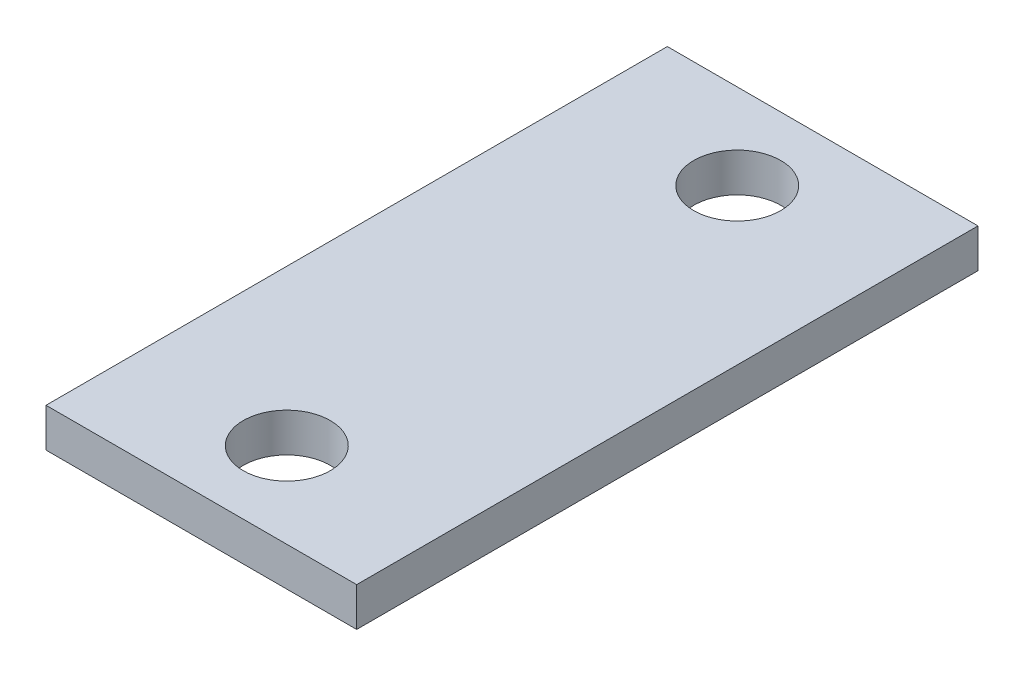
ISO-10303-21;
HEADER;
FILE_DESCRIPTION(('STEP AP214'),'2;1');
FILE_NAME('part.step','',(''),(''),'','','');
FILE_SCHEMA(('AUTOMOTIVE_DESIGN { 1 0 10303 214 1 1 1 1 }'));
ENDSEC;
DATA;
#1=APPLICATION_CONTEXT('core data for automotive mechanical design processes');
#2=APPLICATION_PROTOCOL_DEFINITION('international standard','automotive_design',2000,#1);
#3=PRODUCT_CONTEXT('',#1,'mechanical');
#4=PRODUCT('Part','Part','',(#3));
#5=PRODUCT_RELATED_PRODUCT_CATEGORY('part','',(#4));
#6=PRODUCT_DEFINITION_FORMATION('','',#4);
#7=PRODUCT_DEFINITION_CONTEXT('part definition',#1,'design');
#8=PRODUCT_DEFINITION('design','',#6,#7);
#9=PRODUCT_DEFINITION_SHAPE('','',#8);
#10=(LENGTH_UNIT() NAMED_UNIT(*) SI_UNIT(.MILLI.,.METRE.));
#11=(NAMED_UNIT(*) PLANE_ANGLE_UNIT() SI_UNIT($,.RADIAN.));
#12=(NAMED_UNIT(*) SI_UNIT($,.STERADIAN.) SOLID_ANGLE_UNIT());
#13=UNCERTAINTY_MEASURE_WITH_UNIT(LENGTH_MEASURE(1.E-05),#10,'distance_accuracy_value','');
#14=(GEOMETRIC_REPRESENTATION_CONTEXT(3) GLOBAL_UNCERTAINTY_ASSIGNED_CONTEXT((#13)) GLOBAL_UNIT_ASSIGNED_CONTEXT((#10,
#11,#12)) REPRESENTATION_CONTEXT('',''));
#15=CARTESIAN_POINT('',(0.,0.,0.));
#16=DIRECTION('',(0.,0.,1.));
#17=DIRECTION('',(1.,0.,0.));
#18=AXIS2_PLACEMENT_3D('',#15,#16,#17);
#19=CARTESIAN_POINT('',(0.,6.35,0.));
#20=DIRECTION('',(0.,-1.,0.));
#21=DIRECTION('',(0.,0.,-1.));
#22=AXIS2_PLACEMENT_3D('',#19,#20,#21);
#23=PLANE('',#22);
#24=DIRECTION('',(0.,0.,1.));
#25=VECTOR('',#24,1.);
#26=CARTESIAN_POINT('',(0.,6.35,0.));
#27=LINE('',#26,#25);
#28=CARTESIAN_POINT('',(0.,6.35,-101.6));
#29=VERTEX_POINT('',#28);
#30=CARTESIAN_POINT('',(0.,6.35,0.));
#31=VERTEX_POINT('',#30);
#32=EDGE_CURVE('E92',#29,#31,#27,.T.);
#33=ORIENTED_EDGE('',*,*,#32,.T.);
#34=DIRECTION('',(1.,0.,0.));
#35=VECTOR('',#34,1.);
#36=CARTESIAN_POINT('',(0.,6.35,0.));
#37=LINE('',#36,#35);
#38=CARTESIAN_POINT('',(50.8,6.35,0.));
#39=VERTEX_POINT('',#38);
#40=EDGE_CURVE('E87',#31,#39,#37,.T.);
#41=ORIENTED_EDGE('',*,*,#40,.T.);
#42=DIRECTION('',(0.,0.,-1.));
#43=VECTOR('',#42,1.);
#44=CARTESIAN_POINT('',(50.8,6.35,0.));
#45=LINE('',#44,#43);
#46=CARTESIAN_POINT('',(50.8,6.35,-101.6));
#47=VERTEX_POINT('',#46);
#48=EDGE_CURVE('E90',#39,#47,#45,.T.);
#49=ORIENTED_EDGE('',*,*,#48,.T.);
#50=DIRECTION('',(-1.,0.,0.));
#51=VECTOR('',#50,1.);
#52=CARTESIAN_POINT('',(0.,6.35,-101.6));
#53=LINE('',#52,#51);
#54=EDGE_CURVE('E57',#47,#29,#53,.T.);
#55=ORIENTED_EDGE('',*,*,#54,.T.);
#56=EDGE_LOOP('',(#33,#41,#49,#55));
#57=FACE_BOUND('',#56,.T.);
#58=CARTESIAN_POINT('',(25.4,6.35,-13.97));
#59=DIRECTION('',(0.,1.,0.));
#60=DIRECTION('',(0.,0.,1.));
#61=AXIS2_PLACEMENT_3D('',#58,#59,#60);
#62=CIRCLE('',#61,7.112);
#63=CARTESIAN_POINT('',(25.4,6.35,-6.858));
#64=VERTEX_POINT('',#63);
#65=EDGE_CURVE('E112',#64,#64,#62,.T.);
#66=ORIENTED_EDGE('',*,*,#65,.F.);
#67=EDGE_LOOP('',(#66));
#68=FACE_BOUND('',#67,.T.);
#69=CARTESIAN_POINT('',(25.4,6.35,-87.63));
#70=DIRECTION('',(0.,1.,0.));
#71=DIRECTION('',(0.,0.,1.));
#72=AXIS2_PLACEMENT_3D('',#69,#70,#71);
#73=CIRCLE('',#72,7.112);
#74=CARTESIAN_POINT('',(25.4,6.35,-80.518));
#75=VERTEX_POINT('',#74);
#76=EDGE_CURVE('E134',#75,#75,#73,.T.);
#77=ORIENTED_EDGE('',*,*,#76,.F.);
#78=EDGE_LOOP('',(#77));
#79=FACE_BOUND('',#78,.T.);
#80=ADVANCED_FACE('F39',(#57,#68,#79),#23,.F.);
#81=CARTESIAN_POINT('',(0.,0.,0.));
#82=DIRECTION('',(0.,-1.,0.));
#83=DIRECTION('',(0.,0.,-1.));
#84=AXIS2_PLACEMENT_3D('',#81,#82,#83);
#85=PLANE('',#84);
#86=CARTESIAN_POINT('',(25.4,0.,-13.97));
#87=DIRECTION('',(0.,1.,0.));
#88=DIRECTION('',(0.,0.,1.));
#89=AXIS2_PLACEMENT_3D('',#86,#87,#88);
#90=CIRCLE('',#89,7.112);
#91=CARTESIAN_POINT('',(25.4,0.,-6.858));
#92=VERTEX_POINT('',#91);
#93=EDGE_CURVE('E130',#92,#92,#90,.T.);
#94=ORIENTED_EDGE('',*,*,#93,.T.);
#95=EDGE_LOOP('',(#94));
#96=FACE_BOUND('',#95,.T.);
#97=DIRECTION('',(0.,0.,1.));
#98=VECTOR('',#97,1.);
#99=CARTESIAN_POINT('',(0.,0.,0.));
#100=LINE('',#99,#98);
#101=CARTESIAN_POINT('',(0.,0.,-101.6));
#102=VERTEX_POINT('',#101);
#103=CARTESIAN_POINT('',(0.,0.,0.));
#104=VERTEX_POINT('',#103);
#105=EDGE_CURVE('E108',#102,#104,#100,.T.);
#106=ORIENTED_EDGE('',*,*,#105,.F.);
#107=DIRECTION('',(-1.,0.,0.));
#108=VECTOR('',#107,1.);
#109=CARTESIAN_POINT('',(0.,0.,-101.6));
#110=LINE('',#109,#108);
#111=CARTESIAN_POINT('',(50.8,0.,-101.6));
#112=VERTEX_POINT('',#111);
#113=EDGE_CURVE('E80',#112,#102,#110,.T.);
#114=ORIENTED_EDGE('',*,*,#113,.F.);
#115=DIRECTION('',(0.,0.,-1.));
#116=VECTOR('',#115,1.);
#117=CARTESIAN_POINT('',(50.8,0.,0.));
#118=LINE('',#117,#116);
#119=CARTESIAN_POINT('',(50.8,0.,0.));
#120=VERTEX_POINT('',#119);
#121=EDGE_CURVE('E74',#120,#112,#118,.T.);
#122=ORIENTED_EDGE('',*,*,#121,.F.);
#123=DIRECTION('',(1.,0.,0.));
#124=VECTOR('',#123,1.);
#125=CARTESIAN_POINT('',(0.,0.,0.));
#126=LINE('',#125,#124);
#127=EDGE_CURVE('E97',#104,#120,#126,.T.);
#128=ORIENTED_EDGE('',*,*,#127,.F.);
#129=EDGE_LOOP('',(#106,#114,#122,#128));
#130=FACE_BOUND('',#129,.T.);
#131=CARTESIAN_POINT('',(25.4,0.,-87.63));
#132=DIRECTION('',(0.,1.,0.));
#133=DIRECTION('',(0.,0.,1.));
#134=AXIS2_PLACEMENT_3D('',#131,#132,#133);
#135=CIRCLE('',#134,7.112);
#136=CARTESIAN_POINT('',(25.4,0.,-80.518));
#137=VERTEX_POINT('',#136);
#138=EDGE_CURVE('E138',#137,#137,#135,.T.);
#139=ORIENTED_EDGE('',*,*,#138,.T.);
#140=EDGE_LOOP('',(#139));
#141=FACE_BOUND('',#140,.T.);
#142=ADVANCED_FACE('F125',(#96,#130,#141),#85,.T.);
#143=CARTESIAN_POINT('',(0.,6.35,0.));
#144=DIRECTION('',(1.,0.,0.));
#145=DIRECTION('',(0.,0.,-1.));
#146=AXIS2_PLACEMENT_3D('',#143,#144,#145);
#147=PLANE('',#146);
#148=ORIENTED_EDGE('',*,*,#105,.T.);
#149=DIRECTION('',(0.,-1.,0.));
#150=VECTOR('',#149,1.);
#151=CARTESIAN_POINT('',(0.,6.35,0.));
#152=LINE('',#151,#150);
#153=EDGE_CURVE('E11',#31,#104,#152,.T.);
#154=ORIENTED_EDGE('',*,*,#153,.F.);
#155=ORIENTED_EDGE('',*,*,#32,.F.);
#156=DIRECTION('',(0.,-1.,0.));
#157=VECTOR('',#156,1.);
#158=CARTESIAN_POINT('',(0.,6.35,-101.6));
#159=LINE('',#158,#157);
#160=EDGE_CURVE('E104',#29,#102,#159,.T.);
#161=ORIENTED_EDGE('',*,*,#160,.T.);
#162=EDGE_LOOP('',(#148,#154,#155,#161));
#163=FACE_BOUND('',#162,.T.);
#164=ADVANCED_FACE('F41',(#163),#147,.F.);
#165=CARTESIAN_POINT('',(0.,6.35,0.));
#166=DIRECTION('',(0.,0.,-1.));
#167=DIRECTION('',(-1.,0.,0.));
#168=AXIS2_PLACEMENT_3D('',#165,#166,#167);
#169=PLANE('',#168);
#170=ORIENTED_EDGE('',*,*,#127,.T.);
#171=DIRECTION('',(0.,-1.,0.));
#172=VECTOR('',#171,1.);
#173=CARTESIAN_POINT('',(50.8,6.35,0.));
#174=LINE('',#173,#172);
#175=EDGE_CURVE('E49',#39,#120,#174,.T.);
#176=ORIENTED_EDGE('',*,*,#175,.F.);
#177=ORIENTED_EDGE('',*,*,#40,.F.);
#178=ORIENTED_EDGE('',*,*,#153,.T.);
#179=EDGE_LOOP('',(#170,#176,#177,#178));
#180=FACE_BOUND('',#179,.T.);
#181=ADVANCED_FACE('F96',(#180),#169,.F.);
#182=CARTESIAN_POINT('',(50.8,6.35,0.));
#183=DIRECTION('',(-1.,0.,0.));
#184=DIRECTION('',(0.,0.,1.));
#185=AXIS2_PLACEMENT_3D('',#182,#183,#184);
#186=PLANE('',#185);
#187=ORIENTED_EDGE('',*,*,#121,.T.);
#188=DIRECTION('',(0.,-1.,0.));
#189=VECTOR('',#188,1.);
#190=CARTESIAN_POINT('',(50.8,6.35,-101.6));
#191=LINE('',#190,#189);
#192=EDGE_CURVE('E99',#47,#112,#191,.T.);
#193=ORIENTED_EDGE('',*,*,#192,.F.);
#194=ORIENTED_EDGE('',*,*,#48,.F.);
#195=ORIENTED_EDGE('',*,*,#175,.T.);
#196=EDGE_LOOP('',(#187,#193,#194,#195));
#197=FACE_BOUND('',#196,.T.);
#198=ADVANCED_FACE('F100',(#197),#186,.F.);
#199=CARTESIAN_POINT('',(0.,6.35,-101.6));
#200=DIRECTION('',(0.,0.,1.));
#201=DIRECTION('',(1.,0.,0.));
#202=AXIS2_PLACEMENT_3D('',#199,#200,#201);
#203=PLANE('',#202);
#204=ORIENTED_EDGE('',*,*,#113,.T.);
#205=ORIENTED_EDGE('',*,*,#160,.F.);
#206=ORIENTED_EDGE('',*,*,#54,.F.);
#207=ORIENTED_EDGE('',*,*,#192,.T.);
#208=EDGE_LOOP('',(#204,#205,#206,#207));
#209=FACE_BOUND('',#208,.T.);
#210=ADVANCED_FACE('F122',(#209),#203,.F.);
#211=CARTESIAN_POINT('',(25.4,6.35,-13.97));
#212=DIRECTION('',(0.,-1.,0.));
#213=DIRECTION('',(0.,0.,-1.));
#214=AXIS2_PLACEMENT_3D('',#211,#212,#213);
#215=CYLINDRICAL_SURFACE('',#214,7.112);
#216=ORIENTED_EDGE('',*,*,#65,.T.);
#217=EDGE_LOOP('',(#216));
#218=FACE_BOUND('',#217,.T.);
#219=ORIENTED_EDGE('',*,*,#93,.F.);
#220=EDGE_LOOP('',(#219));
#221=FACE_BOUND('',#220,.T.);
#222=ADVANCED_FACE('F157',(#218,#221),#215,.F.);
#223=CARTESIAN_POINT('',(25.4,6.35,-87.63));
#224=DIRECTION('',(0.,-1.,0.));
#225=DIRECTION('',(0.,0.,-1.));
#226=AXIS2_PLACEMENT_3D('',#223,#224,#225);
#227=CYLINDRICAL_SURFACE('',#226,7.112);
#228=ORIENTED_EDGE('',*,*,#76,.T.);
#229=EDGE_LOOP('',(#228));
#230=FACE_BOUND('',#229,.T.);
#231=ORIENTED_EDGE('',*,*,#138,.F.);
#232=EDGE_LOOP('',(#231));
#233=FACE_BOUND('',#232,.T.);
#234=ADVANCED_FACE('F146',(#230,#233),#227,.F.);
#235=CLOSED_SHELL('',(#80,#142,#164,#181,#198,#210,#222,#234));
#236=MANIFOLD_SOLID_BREP('B2',#235);
#237=ADVANCED_BREP_SHAPE_REPRESENTATION('',(#18,#236),#14);
#238=SHAPE_DEFINITION_REPRESENTATION(#9,#237);
ENDSEC;
END-ISO-10303-21;
